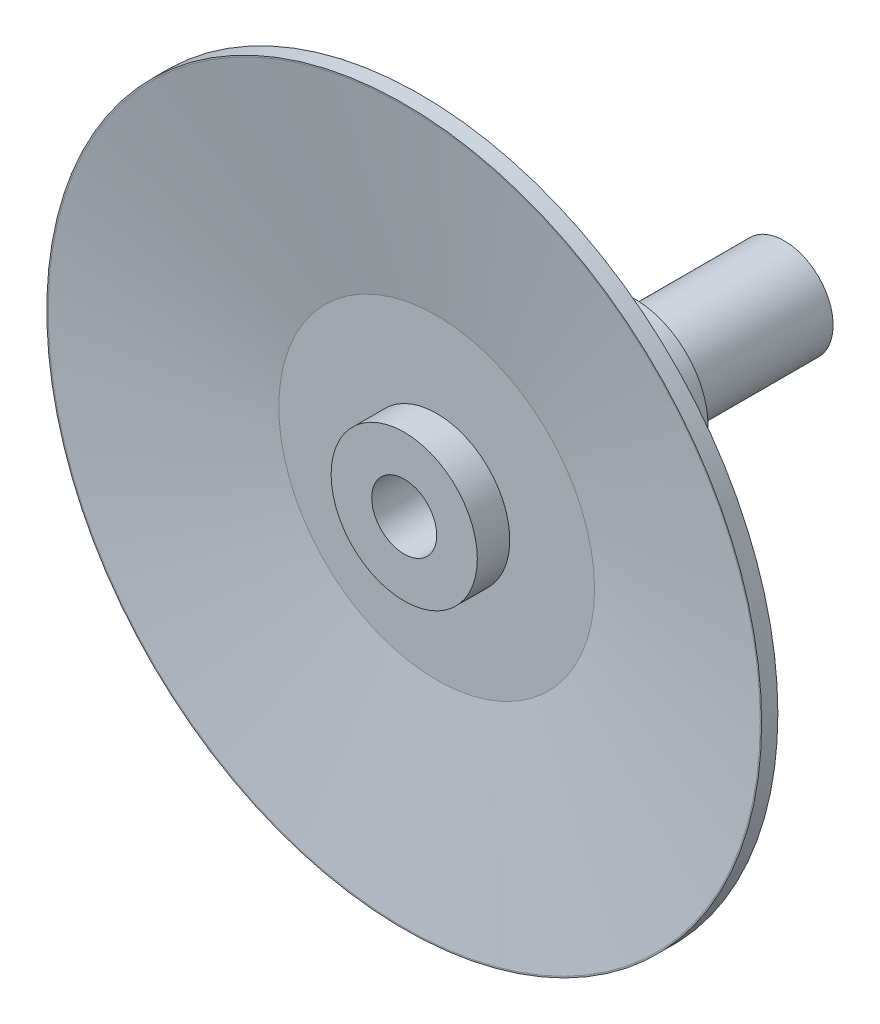
ISO-10303-21;
HEADER;
FILE_DESCRIPTION(('STEP AP214'),'2;1');
FILE_NAME('part.step','',(''),(''),'','','');
FILE_SCHEMA(('AUTOMOTIVE_DESIGN { 1 0 10303 214 1 1 1 1 }'));
ENDSEC;
DATA;
#1=APPLICATION_CONTEXT('core data for automotive mechanical design processes');
#2=APPLICATION_PROTOCOL_DEFINITION('international standard','automotive_design',2000,#1);
#3=PRODUCT_CONTEXT('',#1,'mechanical');
#4=PRODUCT('Part','Part','',(#3));
#5=PRODUCT_RELATED_PRODUCT_CATEGORY('part','',(#4));
#6=PRODUCT_DEFINITION_FORMATION('','',#4);
#7=PRODUCT_DEFINITION_CONTEXT('part definition',#1,'design');
#8=PRODUCT_DEFINITION('design','',#6,#7);
#9=PRODUCT_DEFINITION_SHAPE('','',#8);
#10=(LENGTH_UNIT() NAMED_UNIT(*) SI_UNIT(.MILLI.,.METRE.));
#11=(NAMED_UNIT(*) PLANE_ANGLE_UNIT() SI_UNIT($,.RADIAN.));
#12=(NAMED_UNIT(*) SI_UNIT($,.STERADIAN.) SOLID_ANGLE_UNIT());
#13=UNCERTAINTY_MEASURE_WITH_UNIT(LENGTH_MEASURE(1.E-05),#10,'distance_accuracy_value','');
#14=(GEOMETRIC_REPRESENTATION_CONTEXT(3) GLOBAL_UNCERTAINTY_ASSIGNED_CONTEXT((#13)) GLOBAL_UNIT_ASSIGNED_CONTEXT((#10,
#11,#12)) REPRESENTATION_CONTEXT('',''));
#15=CARTESIAN_POINT('',(0.,0.,0.));
#16=DIRECTION('',(0.,0.,1.));
#17=DIRECTION('',(1.,0.,0.));
#18=AXIS2_PLACEMENT_3D('',#15,#16,#17);
#19=CARTESIAN_POINT('',(0.,0.,91.));
#20=DIRECTION('',(0.,0.,-1.));
#21=DIRECTION('',(-1.,0.,0.));
#22=AXIS2_PLACEMENT_3D('',#19,#20,#21);
#23=CYLINDRICAL_SURFACE('',#22,15.);
#24=CARTESIAN_POINT('',(0.,0.,91.));
#25=DIRECTION('',(0.,0.,-1.));
#26=DIRECTION('',(-1.,0.,0.));
#27=AXIS2_PLACEMENT_3D('',#24,#25,#26);
#28=CIRCLE('',#27,15.);
#29=CARTESIAN_POINT('',(-15.,0.,91.));
#30=VERTEX_POINT('',#29);
#31=EDGE_CURVE('E111',#30,#30,#28,.T.);
#32=ORIENTED_EDGE('',*,*,#31,.T.);
#33=EDGE_LOOP('',(#32));
#34=FACE_BOUND('',#33,.T.);
#35=CARTESIAN_POINT('',(0.,0.,45.));
#36=DIRECTION('',(0.,0.,-1.));
#37=DIRECTION('',(-1.,0.,0.));
#38=AXIS2_PLACEMENT_3D('',#35,#36,#37);
#39=CIRCLE('',#38,15.);
#40=CARTESIAN_POINT('',(-15.,0.,45.));
#41=VERTEX_POINT('',#40);
#42=EDGE_CURVE('E106',#41,#41,#39,.T.);
#43=ORIENTED_EDGE('',*,*,#42,.F.);
#44=EDGE_LOOP('',(#43));
#45=FACE_BOUND('',#44,.T.);
#46=ADVANCED_FACE('F36',(#34,#45),#23,.T.);
#47=CARTESIAN_POINT('',(0.,0.,162.));
#48=DIRECTION('',(0.,0.,-1.));
#49=DIRECTION('',(-1.,0.,0.));
#50=AXIS2_PLACEMENT_3D('',#47,#48,#49);
#51=CYLINDRICAL_SURFACE('',#50,22.5);
#52=CARTESIAN_POINT('',(0.,0.,147.));
#53=DIRECTION('',(0.,0.,1.));
#54=DIRECTION('',(1.,0.,0.));
#55=AXIS2_PLACEMENT_3D('',#52,#53,#54);
#56=CIRCLE('',#55,22.5);
#57=CARTESIAN_POINT('',(22.5,0.,147.));
#58=VERTEX_POINT('',#57);
#59=EDGE_CURVE('E126',#58,#58,#56,.T.);
#60=ORIENTED_EDGE('',*,*,#59,.F.);
#61=EDGE_LOOP('',(#60));
#62=FACE_BOUND('',#61,.T.);
#63=CARTESIAN_POINT('',(0.,0.,91.));
#64=DIRECTION('',(0.,0.,-1.));
#65=DIRECTION('',(-1.,0.,0.));
#66=AXIS2_PLACEMENT_3D('',#63,#64,#65);
#67=CIRCLE('',#66,22.5);
#68=CARTESIAN_POINT('',(-22.5,0.,91.));
#69=VERTEX_POINT('',#68);
#70=EDGE_CURVE('E114',#69,#69,#67,.T.);
#71=ORIENTED_EDGE('',*,*,#70,.F.);
#72=EDGE_LOOP('',(#71));
#73=FACE_BOUND('',#72,.T.);
#74=ADVANCED_FACE('F38',(#62,#73),#51,.T.);
#75=CARTESIAN_POINT('',(0.,0.,162.));
#76=DIRECTION('',(0.,0.,1.));
#77=DIRECTION('',(1.,0.,0.));
#78=AXIS2_PLACEMENT_3D('',#75,#76,#77);
#79=CIRCLE('',#78,22.5);
#80=CARTESIAN_POINT('',(22.5,0.,162.));
#81=VERTEX_POINT('',#80);
#82=EDGE_CURVE('E135',#81,#81,#79,.T.);
#83=ORIENTED_EDGE('',*,*,#82,.F.);
#84=EDGE_LOOP('',(#83));
#85=FACE_BOUND('',#84,.T.);
#86=CARTESIAN_POINT('',(0.,0.,152.));
#87=DIRECTION('',(0.,0.,-1.));
#88=DIRECTION('',(-1.,0.,0.));
#89=AXIS2_PLACEMENT_3D('',#86,#87,#88);
#90=CIRCLE('',#89,22.5);
#91=CARTESIAN_POINT('',(-22.5,0.,152.));
#92=VERTEX_POINT('',#91);
#93=EDGE_CURVE('E138',#92,#92,#90,.T.);
#94=ORIENTED_EDGE('',*,*,#93,.F.);
#95=EDGE_LOOP('',(#94));
#96=FACE_BOUND('',#95,.T.);
#97=ADVANCED_FACE('F165',(#85,#96),#51,.T.);
#98=CARTESIAN_POINT('',(0.,0.,162.));
#99=DIRECTION('',(0.,0.,1.));
#100=DIRECTION('',(1.,0.,0.));
#101=AXIS2_PLACEMENT_3D('',#98,#99,#100);
#102=PLANE('',#101);
#103=CARTESIAN_POINT('',(0.,0.,162.));
#104=DIRECTION('',(0.,0.,-1.));
#105=DIRECTION('',(-1.,0.,0.));
#106=AXIS2_PLACEMENT_3D('',#103,#104,#105);
#107=CIRCLE('',#106,10.);
#108=CARTESIAN_POINT('',(-10.,0.,162.));
#109=VERTEX_POINT('',#108);
#110=EDGE_CURVE('E103',#109,#109,#107,.T.);
#111=ORIENTED_EDGE('',*,*,#110,.T.);
#112=EDGE_LOOP('',(#111));
#113=FACE_BOUND('',#112,.T.);
#114=ORIENTED_EDGE('',*,*,#82,.T.);
#115=EDGE_LOOP('',(#114));
#116=FACE_BOUND('',#115,.T.);
#117=ADVANCED_FACE('F196',(#113,#116),#102,.T.);
#118=CARTESIAN_POINT('',(0.,0.,162.));
#119=DIRECTION('',(0.,0.,1.));
#120=DIRECTION('',(1.,0.,0.));
#121=AXIS2_PLACEMENT_3D('',#118,#119,#120);
#122=PLANE('',#121);
#123=CARTESIAN_POINT('',(0.,0.,162.));
#124=DIRECTION('',(0.,0.,1.));
#125=DIRECTION('',(1.,0.,0.));
#126=AXIS2_PLACEMENT_3D('',#123,#124,#125);
#127=CIRCLE('',#126,110.);
#128=CARTESIAN_POINT('',(110.,0.,162.));
#129=VERTEX_POINT('',#128);
#130=EDGE_CURVE('E117',#129,#129,#127,.T.);
#131=ORIENTED_EDGE('',*,*,#130,.T.);
#132=EDGE_LOOP('',(#131));
#133=FACE_BOUND('',#132,.T.);
#134=CARTESIAN_POINT('',(0.,0.,162.));
#135=DIRECTION('',(0.,0.,1.));
#136=DIRECTION('',(1.,0.,0.));
#137=AXIS2_PLACEMENT_3D('',#134,#135,#136);
#138=CIRCLE('',#137,109.592881078949);
#139=CARTESIAN_POINT('',(109.592881078949,0.,162.));
#140=VERTEX_POINT('',#139);
#141=EDGE_CURVE('E132',#140,#140,#138,.T.);
#142=ORIENTED_EDGE('',*,*,#141,.F.);
#143=EDGE_LOOP('',(#142));
#144=FACE_BOUND('',#143,.T.);
#145=ADVANCED_FACE('F193',(#133,#144),#122,.T.);
#146=CARTESIAN_POINT('',(0.,0.,162.));
#147=DIRECTION('',(0.,0.,1.));
#148=DIRECTION('',(1.,0.,0.));
#149=AXIS2_PLACEMENT_3D('',#146,#147,#148);
#150=CONICAL_SURFACE('',#149,109.592881078949,1.40830721757769);
#151=CARTESIAN_POINT('',(0.,0.,152.));
#152=DIRECTION('',(0.,0.,1.));
#153=DIRECTION('',(1.,0.,0.));
#154=AXIS2_PLACEMENT_3D('',#151,#152,#153);
#155=CIRCLE('',#154,48.5928810789488);
#156=CARTESIAN_POINT('',(48.5928810789488,0.,152.));
#157=VERTEX_POINT('',#156);
#158=EDGE_CURVE('E129',#157,#157,#155,.T.);
#159=ORIENTED_EDGE('',*,*,#158,.F.);
#160=EDGE_LOOP('',(#159));
#161=FACE_BOUND('',#160,.T.);
#162=ORIENTED_EDGE('',*,*,#141,.T.);
#163=EDGE_LOOP('',(#162));
#164=FACE_BOUND('',#163,.T.);
#165=ADVANCED_FACE('F189',(#161,#164),#150,.F.);
#166=CARTESIAN_POINT('',(0.,0.,152.));
#167=DIRECTION('',(0.,0.,-1.));
#168=DIRECTION('',(-1.,0.,0.));
#169=AXIS2_PLACEMENT_3D('',#166,#167,#168);
#170=PLANE('',#169);
#171=ORIENTED_EDGE('',*,*,#93,.T.);
#172=EDGE_LOOP('',(#171));
#173=FACE_BOUND('',#172,.T.);
#174=ORIENTED_EDGE('',*,*,#158,.T.);
#175=EDGE_LOOP('',(#174));
#176=FACE_BOUND('',#175,.T.);
#177=ADVANCED_FACE('F185',(#173,#176),#170,.F.);
#178=CARTESIAN_POINT('',(0.,0.,147.));
#179=DIRECTION('',(0.,0.,-1.));
#180=DIRECTION('',(-1.,0.,0.));
#181=AXIS2_PLACEMENT_3D('',#178,#179,#180);
#182=PLANE('',#181);
#183=ORIENTED_EDGE('',*,*,#59,.T.);
#184=EDGE_LOOP('',(#183));
#185=FACE_BOUND('',#184,.T.);
#186=CARTESIAN_POINT('',(0.,0.,147.));
#187=DIRECTION('',(0.,0.,1.));
#188=DIRECTION('',(1.,0.,0.));
#189=AXIS2_PLACEMENT_3D('',#186,#187,#188);
#190=CIRCLE('',#189,49.);
#191=CARTESIAN_POINT('',(49.,0.,147.));
#192=VERTEX_POINT('',#191);
#193=EDGE_CURVE('E123',#192,#192,#190,.T.);
#194=ORIENTED_EDGE('',*,*,#193,.F.);
#195=EDGE_LOOP('',(#194));
#196=FACE_BOUND('',#195,.T.);
#197=ADVANCED_FACE('F181',(#185,#196),#182,.T.);
#198=CARTESIAN_POINT('',(0.,0.,157.));
#199=DIRECTION('',(0.,0.,1.));
#200=DIRECTION('',(1.,0.,0.));
#201=AXIS2_PLACEMENT_3D('',#198,#199,#200);
#202=CONICAL_SURFACE('',#201,110.,1.40830721757769);
#203=ORIENTED_EDGE('',*,*,#193,.T.);
#204=EDGE_LOOP('',(#203));
#205=FACE_BOUND('',#204,.T.);
#206=CARTESIAN_POINT('',(0.,0.,157.));
#207=DIRECTION('',(0.,0.,1.));
#208=DIRECTION('',(1.,0.,0.));
#209=AXIS2_PLACEMENT_3D('',#206,#207,#208);
#210=CIRCLE('',#209,110.);
#211=CARTESIAN_POINT('',(110.,0.,157.));
#212=VERTEX_POINT('',#211);
#213=EDGE_CURVE('E120',#212,#212,#210,.T.);
#214=ORIENTED_EDGE('',*,*,#213,.F.);
#215=EDGE_LOOP('',(#214));
#216=FACE_BOUND('',#215,.T.);
#217=ADVANCED_FACE('F177',(#205,#216),#202,.T.);
#218=CARTESIAN_POINT('',(0.,0.,162.));
#219=DIRECTION('',(0.,0.,1.));
#220=DIRECTION('',(1.,0.,0.));
#221=AXIS2_PLACEMENT_3D('',#218,#219,#220);
#222=CYLINDRICAL_SURFACE('',#221,110.);
#223=ORIENTED_EDGE('',*,*,#213,.T.);
#224=EDGE_LOOP('',(#223));
#225=FACE_BOUND('',#224,.T.);
#226=ORIENTED_EDGE('',*,*,#130,.F.);
#227=EDGE_LOOP('',(#226));
#228=FACE_BOUND('',#227,.T.);
#229=ADVANCED_FACE('F173',(#225,#228),#222,.T.);
#230=CARTESIAN_POINT('',(0.,0.,91.));
#231=DIRECTION('',(0.,0.,-1.));
#232=DIRECTION('',(-1.,0.,0.));
#233=AXIS2_PLACEMENT_3D('',#230,#231,#232);
#234=PLANE('',#233);
#235=ORIENTED_EDGE('',*,*,#31,.F.);
#236=EDGE_LOOP('',(#235));
#237=FACE_BOUND('',#236,.T.);
#238=ORIENTED_EDGE('',*,*,#70,.T.);
#239=EDGE_LOOP('',(#238));
#240=FACE_BOUND('',#239,.T.);
#241=ADVANCED_FACE('F170',(#237,#240),#234,.T.);
#242=CARTESIAN_POINT('',(0.,0.,45.));
#243=DIRECTION('',(0.,0.,-1.));
#244=DIRECTION('',(-1.,0.,0.));
#245=AXIS2_PLACEMENT_3D('',#242,#243,#244);
#246=PLANE('',#245);
#247=DIRECTION('',(0.,1.,0.));
#248=VECTOR('',#247,1.);
#249=CARTESIAN_POINT('',(-1.5,-8.5,45.));
#250=LINE('',#249,#248);
#251=CARTESIAN_POINT('',(-1.5,-11.5,45.));
#252=VERTEX_POINT('',#251);
#253=CARTESIAN_POINT('',(-1.5,-9.88685996664259,45.));
#254=VERTEX_POINT('',#253);
#255=EDGE_CURVE('E96',#252,#254,#250,.T.);
#256=ORIENTED_EDGE('',*,*,#255,.F.);
#257=DIRECTION('',(-1.,0.,0.));
#258=VECTOR('',#257,1.);
#259=CARTESIAN_POINT('',(1.5,-11.5,45.));
#260=LINE('',#259,#258);
#261=CARTESIAN_POINT('',(1.5,-11.5,45.));
#262=VERTEX_POINT('',#261);
#263=EDGE_CURVE('E99',#262,#252,#260,.T.);
#264=ORIENTED_EDGE('',*,*,#263,.F.);
#265=DIRECTION('',(0.,-1.,0.));
#266=VECTOR('',#265,1.);
#267=CARTESIAN_POINT('',(1.5,-8.5,45.));
#268=LINE('',#267,#266);
#269=CARTESIAN_POINT('',(1.5,-9.88685996664259,45.));
#270=VERTEX_POINT('',#269);
#271=EDGE_CURVE('E86',#270,#262,#268,.T.);
#272=ORIENTED_EDGE('',*,*,#271,.F.);
#273=CARTESIAN_POINT('',(0.,0.,45.));
#274=DIRECTION('',(0.,0.,-1.));
#275=DIRECTION('',(-1.,0.,0.));
#276=AXIS2_PLACEMENT_3D('',#273,#274,#275);
#277=CIRCLE('',#276,10.);
#278=EDGE_CURVE('E101',#254,#270,#277,.T.);
#279=ORIENTED_EDGE('',*,*,#278,.F.);
#280=EDGE_LOOP('',(#256,#264,#272,#279));
#281=FACE_BOUND('',#280,.T.);
#282=ORIENTED_EDGE('',*,*,#42,.T.);
#283=EDGE_LOOP('',(#282));
#284=FACE_BOUND('',#283,.T.);
#285=ADVANCED_FACE('F146',(#281,#284),#246,.T.);
#286=CARTESIAN_POINT('',(0.,0.,162.));
#287=DIRECTION('',(0.,0.,-1.));
#288=DIRECTION('',(-1.,0.,0.));
#289=AXIS2_PLACEMENT_3D('',#286,#287,#288);
#290=CYLINDRICAL_SURFACE('',#289,10.);
#291=ORIENTED_EDGE('',*,*,#110,.F.);
#292=EDGE_LOOP('',(#291));
#293=FACE_BOUND('',#292,.T.);
#294=CARTESIAN_POINT('',(0.,0.,95.));
#295=DIRECTION('',(0.,0.,-1.));
#296=DIRECTION('',(-1.,0.,0.));
#297=AXIS2_PLACEMENT_3D('',#294,#295,#296);
#298=CIRCLE('',#297,10.);
#299=CARTESIAN_POINT('',(-1.5,-9.88685996664259,95.));
#300=VERTEX_POINT('',#299);
#301=CARTESIAN_POINT('',(1.5,-9.88685996664259,95.));
#302=VERTEX_POINT('',#301);
#303=EDGE_CURVE('E56',#300,#302,#298,.F.);
#304=ORIENTED_EDGE('',*,*,#303,.F.);
#305=DIRECTION('',(0.,0.,-1.));
#306=VECTOR('',#305,1.);
#307=CARTESIAN_POINT('',(-1.5,-9.88685996664259,162.));
#308=LINE('',#307,#306);
#309=EDGE_CURVE('E11',#300,#254,#308,.T.);
#310=ORIENTED_EDGE('',*,*,#309,.T.);
#311=ORIENTED_EDGE('',*,*,#278,.T.);
#312=DIRECTION('',(0.,0.,-1.));
#313=VECTOR('',#312,1.);
#314=CARTESIAN_POINT('',(1.5,-9.88685996664259,162.));
#315=LINE('',#314,#313);
#316=EDGE_CURVE('E44',#270,#302,#315,.F.);
#317=ORIENTED_EDGE('',*,*,#316,.T.);
#318=EDGE_LOOP('',(#304,#310,#311,#317));
#319=FACE_BOUND('',#318,.T.);
#320=ADVANCED_FACE('F142',(#293,#319),#290,.F.);
#321=CARTESIAN_POINT('',(-1.5,-8.5,95.));
#322=DIRECTION('',(-1.,0.,0.));
#323=DIRECTION('',(0.,-1.,0.));
#324=AXIS2_PLACEMENT_3D('',#321,#322,#323);
#325=PLANE('',#324);
#326=DIRECTION('',(0.,1.,0.));
#327=VECTOR('',#326,1.);
#328=CARTESIAN_POINT('',(-1.5,-8.5,95.));
#329=LINE('',#328,#327);
#330=CARTESIAN_POINT('',(-1.5,-11.5,95.));
#331=VERTEX_POINT('',#330);
#332=EDGE_CURVE('E51',#331,#300,#329,.T.);
#333=ORIENTED_EDGE('',*,*,#332,.F.);
#334=DIRECTION('',(0.,0.,-1.));
#335=VECTOR('',#334,1.);
#336=CARTESIAN_POINT('',(-1.5,-11.5,95.));
#337=LINE('',#336,#335);
#338=EDGE_CURVE('E90',#331,#252,#337,.T.);
#339=ORIENTED_EDGE('',*,*,#338,.T.);
#340=ORIENTED_EDGE('',*,*,#255,.T.);
#341=ORIENTED_EDGE('',*,*,#309,.F.);
#342=EDGE_LOOP('',(#333,#339,#340,#341));
#343=FACE_BOUND('',#342,.T.);
#344=ADVANCED_FACE('F149',(#343),#325,.F.);
#345=CARTESIAN_POINT('',(1.5,-8.5,95.));
#346=DIRECTION('',(1.,0.,0.));
#347=DIRECTION('',(0.,0.,-1.));
#348=AXIS2_PLACEMENT_3D('',#345,#346,#347);
#349=PLANE('',#348);
#350=ORIENTED_EDGE('',*,*,#271,.T.);
#351=DIRECTION('',(0.,0.,-1.));
#352=VECTOR('',#351,1.);
#353=CARTESIAN_POINT('',(1.5,-11.5,95.));
#354=LINE('',#353,#352);
#355=CARTESIAN_POINT('',(1.5,-11.5,95.));
#356=VERTEX_POINT('',#355);
#357=EDGE_CURVE('E83',#356,#262,#354,.T.);
#358=ORIENTED_EDGE('',*,*,#357,.F.);
#359=DIRECTION('',(0.,-1.,0.));
#360=VECTOR('',#359,1.);
#361=CARTESIAN_POINT('',(1.5,-8.5,95.));
#362=LINE('',#361,#360);
#363=EDGE_CURVE('E74',#302,#356,#362,.T.);
#364=ORIENTED_EDGE('',*,*,#363,.F.);
#365=ORIENTED_EDGE('',*,*,#316,.F.);
#366=EDGE_LOOP('',(#350,#358,#364,#365));
#367=FACE_BOUND('',#366,.T.);
#368=ADVANCED_FACE('F84',(#367),#349,.F.);
#369=CARTESIAN_POINT('',(0.,0.,95.));
#370=DIRECTION('',(0.,0.,-1.));
#371=DIRECTION('',(-1.,0.,0.));
#372=AXIS2_PLACEMENT_3D('',#369,#370,#371);
#373=PLANE('',#372);
#374=ORIENTED_EDGE('',*,*,#303,.T.);
#375=ORIENTED_EDGE('',*,*,#363,.T.);
#376=DIRECTION('',(-1.,0.,0.));
#377=VECTOR('',#376,1.);
#378=CARTESIAN_POINT('',(1.5,-11.5,95.));
#379=LINE('',#378,#377);
#380=EDGE_CURVE('E78',#356,#331,#379,.T.);
#381=ORIENTED_EDGE('',*,*,#380,.T.);
#382=ORIENTED_EDGE('',*,*,#332,.T.);
#383=EDGE_LOOP('',(#374,#375,#381,#382));
#384=FACE_BOUND('',#383,.T.);
#385=ADVANCED_FACE('F76',(#384),#373,.T.);
#386=CARTESIAN_POINT('',(1.5,-11.5,95.));
#387=DIRECTION('',(0.,-1.,0.));
#388=DIRECTION('',(0.,0.,-1.));
#389=AXIS2_PLACEMENT_3D('',#386,#387,#388);
#390=PLANE('',#389);
#391=ORIENTED_EDGE('',*,*,#263,.T.);
#392=ORIENTED_EDGE('',*,*,#338,.F.);
#393=ORIENTED_EDGE('',*,*,#380,.F.);
#394=ORIENTED_EDGE('',*,*,#357,.T.);
#395=EDGE_LOOP('',(#391,#392,#393,#394));
#396=FACE_BOUND('',#395,.T.);
#397=ADVANCED_FACE('F92',(#396),#390,.F.);
#398=CLOSED_SHELL('',(#46,#74,#97,#117,#145,#165,#177,#197,#217,#229,#241,#285,#320,#344,#368,
#385,#397));
#399=MANIFOLD_SOLID_BREP('B2',#398);
#400=ADVANCED_BREP_SHAPE_REPRESENTATION('',(#18,#399),#14);
#401=SHAPE_DEFINITION_REPRESENTATION(#9,#400);
ENDSEC;
END-ISO-10303-21;
